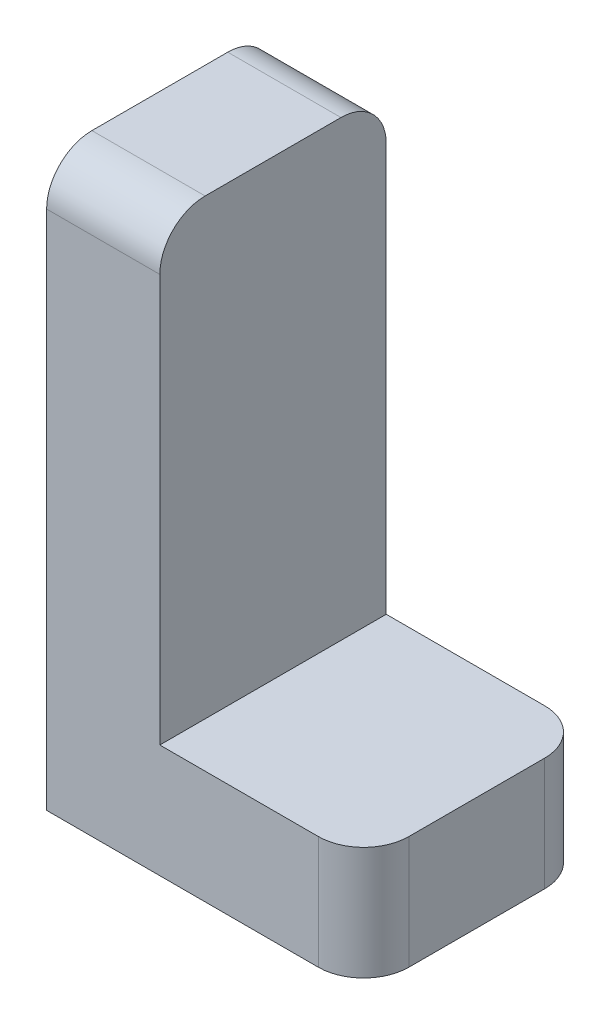
ISO-10303-21;
HEADER;
FILE_DESCRIPTION(('STEP AP214'),'2;1');
FILE_NAME('part.step','',(''),(''),'','','');
FILE_SCHEMA(('AUTOMOTIVE_DESIGN { 1 0 10303 214 1 1 1 1 }'));
ENDSEC;
DATA;
#1=APPLICATION_CONTEXT('core data for automotive mechanical design processes');
#2=APPLICATION_PROTOCOL_DEFINITION('international standard','automotive_design',2000,#1);
#3=PRODUCT_CONTEXT('',#1,'mechanical');
#4=PRODUCT('Part','Part','',(#3));
#5=PRODUCT_RELATED_PRODUCT_CATEGORY('part','',(#4));
#6=PRODUCT_DEFINITION_FORMATION('','',#4);
#7=PRODUCT_DEFINITION_CONTEXT('part definition',#1,'design');
#8=PRODUCT_DEFINITION('design','',#6,#7);
#9=PRODUCT_DEFINITION_SHAPE('','',#8);
#10=(LENGTH_UNIT() NAMED_UNIT(*) SI_UNIT(.MILLI.,.METRE.));
#11=(NAMED_UNIT(*) PLANE_ANGLE_UNIT() SI_UNIT($,.RADIAN.));
#12=(NAMED_UNIT(*) SI_UNIT($,.STERADIAN.) SOLID_ANGLE_UNIT());
#13=UNCERTAINTY_MEASURE_WITH_UNIT(LENGTH_MEASURE(1.E-05),#10,'distance_accuracy_value','');
#14=(GEOMETRIC_REPRESENTATION_CONTEXT(3) GLOBAL_UNCERTAINTY_ASSIGNED_CONTEXT((#13)) GLOBAL_UNIT_ASSIGNED_CONTEXT((#10,
#11,#12)) REPRESENTATION_CONTEXT('',''));
#15=CARTESIAN_POINT('',(0.,0.,0.));
#16=DIRECTION('',(0.,0.,1.));
#17=DIRECTION('',(1.,0.,0.));
#18=AXIS2_PLACEMENT_3D('',#15,#16,#17);
#19=CARTESIAN_POINT('',(12.,0.,2.));
#20=DIRECTION('',(0.,1.,0.));
#21=DIRECTION('',(0.,0.,1.));
#22=AXIS2_PLACEMENT_3D('',#19,#20,#21);
#23=CYLINDRICAL_SURFACE('',#22,2.);
#24=DIRECTION('',(0.,-1.,0.));
#25=VECTOR('',#24,1.);
#26=CARTESIAN_POINT('',(12.,0.,0.));
#27=LINE('',#26,#25);
#28=CARTESIAN_POINT('',(12.,5.,0.));
#29=VERTEX_POINT('',#28);
#30=CARTESIAN_POINT('',(12.,0.,0.));
#31=VERTEX_POINT('',#30);
#32=EDGE_CURVE('E288',#29,#31,#27,.T.);
#33=ORIENTED_EDGE('',*,*,#32,.F.);
#34=CARTESIAN_POINT('',(12.,5.,2.));
#35=DIRECTION('',(0.,-1.,0.));
#36=DIRECTION('',(0.,0.,-1.));
#37=AXIS2_PLACEMENT_3D('',#34,#35,#36);
#38=CIRCLE('',#37,2.);
#39=CARTESIAN_POINT('',(14.,5.,2.));
#40=VERTEX_POINT('',#39);
#41=EDGE_CURVE('E53',#40,#29,#38,.F.);
#42=ORIENTED_EDGE('',*,*,#41,.F.);
#43=DIRECTION('',(0.,-1.,0.));
#44=VECTOR('',#43,1.);
#45=CARTESIAN_POINT('',(14.,0.,2.));
#46=LINE('',#45,#44);
#47=CARTESIAN_POINT('',(14.,0.,2.));
#48=VERTEX_POINT('',#47);
#49=EDGE_CURVE('E292',#48,#40,#46,.F.);
#50=ORIENTED_EDGE('',*,*,#49,.F.);
#51=CARTESIAN_POINT('',(12.,0.,2.));
#52=DIRECTION('',(0.,1.,0.));
#53=DIRECTION('',(0.,0.,1.));
#54=AXIS2_PLACEMENT_3D('',#51,#52,#53);
#55=CIRCLE('',#54,2.);
#56=EDGE_CURVE('E11',#31,#48,#55,.F.);
#57=ORIENTED_EDGE('',*,*,#56,.F.);
#58=EDGE_LOOP('',(#33,#42,#50,#57));
#59=FACE_BOUND('',#58,.T.);
#60=ADVANCED_FACE('F45',(#59),#23,.T.);
#61=CARTESIAN_POINT('',(12.,0.,8.));
#62=DIRECTION('',(0.,1.,0.));
#63=DIRECTION('',(0.,0.,1.));
#64=AXIS2_PLACEMENT_3D('',#61,#62,#63);
#65=CYLINDRICAL_SURFACE('',#64,2.);
#66=DIRECTION('',(0.,1.,0.));
#67=VECTOR('',#66,1.);
#68=CARTESIAN_POINT('',(12.,0.,10.));
#69=LINE('',#68,#67);
#70=CARTESIAN_POINT('',(12.,0.,10.));
#71=VERTEX_POINT('',#70);
#72=CARTESIAN_POINT('',(12.,5.,10.));
#73=VERTEX_POINT('',#72);
#74=EDGE_CURVE('E274',#71,#73,#69,.T.);
#75=ORIENTED_EDGE('',*,*,#74,.F.);
#76=CARTESIAN_POINT('',(12.,0.,8.));
#77=DIRECTION('',(0.,1.,0.));
#78=DIRECTION('',(0.,0.,1.));
#79=AXIS2_PLACEMENT_3D('',#76,#77,#78);
#80=CIRCLE('',#79,2.);
#81=CARTESIAN_POINT('',(14.,0.,8.));
#82=VERTEX_POINT('',#81);
#83=EDGE_CURVE('E282',#82,#71,#80,.F.);
#84=ORIENTED_EDGE('',*,*,#83,.F.);
#85=DIRECTION('',(0.,1.,0.));
#86=VECTOR('',#85,1.);
#87=CARTESIAN_POINT('',(14.,5.,8.));
#88=LINE('',#87,#86);
#89=CARTESIAN_POINT('',(14.,5.,8.));
#90=VERTEX_POINT('',#89);
#91=EDGE_CURVE('E278',#90,#82,#88,.F.);
#92=ORIENTED_EDGE('',*,*,#91,.F.);
#93=CARTESIAN_POINT('',(12.,5.,8.));
#94=DIRECTION('',(0.,-1.,0.));
#95=DIRECTION('',(0.,0.,-1.));
#96=AXIS2_PLACEMENT_3D('',#93,#94,#95);
#97=CIRCLE('',#96,2.);
#98=EDGE_CURVE('E285',#73,#90,#97,.F.);
#99=ORIENTED_EDGE('',*,*,#98,.F.);
#100=EDGE_LOOP('',(#75,#84,#92,#99));
#101=FACE_BOUND('',#100,.T.);
#102=ADVANCED_FACE('F321',(#101),#65,.T.);
#103=CARTESIAN_POINT('',(0.,23.,2.));
#104=DIRECTION('',(-1.,0.,0.));
#105=DIRECTION('',(0.,0.,1.));
#106=AXIS2_PLACEMENT_3D('',#103,#104,#105);
#107=CYLINDRICAL_SURFACE('',#106,2.);
#108=DIRECTION('',(1.,0.,0.));
#109=VECTOR('',#108,1.);
#110=CARTESIAN_POINT('',(0.,23.,0.));
#111=LINE('',#110,#109);
#112=CARTESIAN_POINT('',(0.,23.,0.));
#113=VERTEX_POINT('',#112);
#114=CARTESIAN_POINT('',(5.,23.,0.));
#115=VERTEX_POINT('',#114);
#116=EDGE_CURVE('E260',#113,#115,#111,.T.);
#117=ORIENTED_EDGE('',*,*,#116,.F.);
#118=CARTESIAN_POINT('',(0.,23.,2.));
#119=DIRECTION('',(1.,0.,0.));
#120=DIRECTION('',(0.,0.,-1.));
#121=AXIS2_PLACEMENT_3D('',#118,#119,#120);
#122=CIRCLE('',#121,2.);
#123=CARTESIAN_POINT('',(0.,25.,2.));
#124=VERTEX_POINT('',#123);
#125=EDGE_CURVE('E268',#124,#113,#122,.F.);
#126=ORIENTED_EDGE('',*,*,#125,.F.);
#127=DIRECTION('',(1.,0.,0.));
#128=VECTOR('',#127,1.);
#129=CARTESIAN_POINT('',(0.,25.,2.));
#130=LINE('',#129,#128);
#131=CARTESIAN_POINT('',(5.,25.,2.));
#132=VERTEX_POINT('',#131);
#133=EDGE_CURVE('E264',#132,#124,#130,.F.);
#134=ORIENTED_EDGE('',*,*,#133,.F.);
#135=CARTESIAN_POINT('',(5.,23.,2.));
#136=DIRECTION('',(-1.,0.,0.));
#137=DIRECTION('',(0.,0.,1.));
#138=AXIS2_PLACEMENT_3D('',#135,#136,#137);
#139=CIRCLE('',#138,2.);
#140=EDGE_CURVE('E271',#115,#132,#139,.F.);
#141=ORIENTED_EDGE('',*,*,#140,.F.);
#142=EDGE_LOOP('',(#117,#126,#134,#141));
#143=FACE_BOUND('',#142,.T.);
#144=ADVANCED_FACE('F331',(#143),#107,.T.);
#145=CARTESIAN_POINT('',(0.,23.,8.));
#146=DIRECTION('',(-1.,0.,0.));
#147=DIRECTION('',(0.,0.,1.));
#148=AXIS2_PLACEMENT_3D('',#145,#146,#147);
#149=CYLINDRICAL_SURFACE('',#148,2.);
#150=DIRECTION('',(-1.,0.,0.));
#151=VECTOR('',#150,1.);
#152=CARTESIAN_POINT('',(0.,23.,10.));
#153=LINE('',#152,#151);
#154=CARTESIAN_POINT('',(5.,23.,10.));
#155=VERTEX_POINT('',#154);
#156=CARTESIAN_POINT('',(0.,23.,10.));
#157=VERTEX_POINT('',#156);
#158=EDGE_CURVE('E246',#155,#157,#153,.T.);
#159=ORIENTED_EDGE('',*,*,#158,.F.);
#160=CARTESIAN_POINT('',(5.,23.,8.));
#161=DIRECTION('',(-1.,0.,0.));
#162=DIRECTION('',(0.,0.,1.));
#163=AXIS2_PLACEMENT_3D('',#160,#161,#162);
#164=CIRCLE('',#163,2.);
#165=CARTESIAN_POINT('',(5.,25.,8.));
#166=VERTEX_POINT('',#165);
#167=EDGE_CURVE('E254',#166,#155,#164,.F.);
#168=ORIENTED_EDGE('',*,*,#167,.F.);
#169=DIRECTION('',(-1.,0.,0.));
#170=VECTOR('',#169,1.);
#171=CARTESIAN_POINT('',(0.,25.,8.));
#172=LINE('',#171,#170);
#173=CARTESIAN_POINT('',(0.,25.,8.));
#174=VERTEX_POINT('',#173);
#175=EDGE_CURVE('E250',#174,#166,#172,.F.);
#176=ORIENTED_EDGE('',*,*,#175,.F.);
#177=CARTESIAN_POINT('',(0.,23.,8.));
#178=DIRECTION('',(1.,0.,0.));
#179=DIRECTION('',(0.,0.,-1.));
#180=AXIS2_PLACEMENT_3D('',#177,#178,#179);
#181=CIRCLE('',#180,2.);
#182=EDGE_CURVE('E257',#157,#174,#181,.F.);
#183=ORIENTED_EDGE('',*,*,#182,.F.);
#184=EDGE_LOOP('',(#159,#168,#176,#183));
#185=FACE_BOUND('',#184,.T.);
#186=ADVANCED_FACE('F337',(#185),#149,.T.);
#187=CARTESIAN_POINT('',(14.,5.,10.));
#188=DIRECTION('',(-1.,0.,0.));
#189=DIRECTION('',(0.,0.,1.));
#190=AXIS2_PLACEMENT_3D('',#187,#188,#189);
#191=PLANE('',#190);
#192=DIRECTION('',(0.,0.,-1.));
#193=VECTOR('',#192,1.);
#194=CARTESIAN_POINT('',(14.,0.,10.));
#195=LINE('',#194,#193);
#196=EDGE_CURVE('E211',#82,#48,#195,.T.);
#197=ORIENTED_EDGE('',*,*,#196,.T.);
#198=ORIENTED_EDGE('',*,*,#49,.T.);
#199=DIRECTION('',(0.,0.,-1.));
#200=VECTOR('',#199,1.);
#201=CARTESIAN_POINT('',(14.,5.,10.));
#202=LINE('',#201,#200);
#203=EDGE_CURVE('E242',#90,#40,#202,.T.);
#204=ORIENTED_EDGE('',*,*,#203,.F.);
#205=ORIENTED_EDGE('',*,*,#91,.T.);
#206=EDGE_LOOP('',(#197,#198,#204,#205));
#207=FACE_BOUND('',#206,.T.);
#208=ADVANCED_FACE('F323',(#207),#191,.F.);
#209=CARTESIAN_POINT('',(14.,5.,10.));
#210=DIRECTION('',(0.,-1.,0.));
#211=DIRECTION('',(0.,0.,-1.));
#212=AXIS2_PLACEMENT_3D('',#209,#210,#211);
#213=PLANE('',#212);
#214=ORIENTED_EDGE('',*,*,#203,.T.);
#215=ORIENTED_EDGE('',*,*,#41,.T.);
#216=DIRECTION('',(-1.,0.,0.));
#217=VECTOR('',#216,1.);
#218=CARTESIAN_POINT('',(14.,5.,0.));
#219=LINE('',#218,#217);
#220=CARTESIAN_POINT('',(5.,5.,0.));
#221=VERTEX_POINT('',#220);
#222=EDGE_CURVE('E190',#29,#221,#219,.T.);
#223=ORIENTED_EDGE('',*,*,#222,.T.);
#224=DIRECTION('',(0.,0.,-1.));
#225=VECTOR('',#224,1.);
#226=CARTESIAN_POINT('',(5.,5.,10.));
#227=LINE('',#226,#225);
#228=CARTESIAN_POINT('',(5.,5.,10.));
#229=VERTEX_POINT('',#228);
#230=EDGE_CURVE('E238',#229,#221,#227,.T.);
#231=ORIENTED_EDGE('',*,*,#230,.F.);
#232=DIRECTION('',(-1.,0.,0.));
#233=VECTOR('',#232,1.);
#234=CARTESIAN_POINT('',(14.,5.,10.));
#235=LINE('',#234,#233);
#236=EDGE_CURVE('E196',#73,#229,#235,.T.);
#237=ORIENTED_EDGE('',*,*,#236,.F.);
#238=ORIENTED_EDGE('',*,*,#98,.T.);
#239=EDGE_LOOP('',(#214,#215,#223,#231,#237,#238));
#240=FACE_BOUND('',#239,.T.);
#241=ADVANCED_FACE('F298',(#240),#213,.F.);
#242=CARTESIAN_POINT('',(5.,5.,10.));
#243=DIRECTION('',(-1.,0.,0.));
#244=DIRECTION('',(0.,0.,1.));
#245=AXIS2_PLACEMENT_3D('',#242,#243,#244);
#246=PLANE('',#245);
#247=DIRECTION('',(0.,1.,0.));
#248=VECTOR('',#247,1.);
#249=CARTESIAN_POINT('',(5.,5.,0.));
#250=LINE('',#249,#248);
#251=EDGE_CURVE('E214',#221,#115,#250,.T.);
#252=ORIENTED_EDGE('',*,*,#251,.T.);
#253=ORIENTED_EDGE('',*,*,#140,.T.);
#254=DIRECTION('',(0.,0.,-1.));
#255=VECTOR('',#254,1.);
#256=CARTESIAN_POINT('',(5.,25.,10.));
#257=LINE('',#256,#255);
#258=EDGE_CURVE('E234',#166,#132,#257,.T.);
#259=ORIENTED_EDGE('',*,*,#258,.F.);
#260=ORIENTED_EDGE('',*,*,#167,.T.);
#261=DIRECTION('',(0.,1.,0.));
#262=VECTOR('',#261,1.);
#263=CARTESIAN_POINT('',(5.,5.,10.));
#264=LINE('',#263,#262);
#265=EDGE_CURVE('E199',#229,#155,#264,.T.);
#266=ORIENTED_EDGE('',*,*,#265,.F.);
#267=ORIENTED_EDGE('',*,*,#230,.T.);
#268=EDGE_LOOP('',(#252,#253,#259,#260,#266,#267));
#269=FACE_BOUND('',#268,.T.);
#270=ADVANCED_FACE('F310',(#269),#246,.F.);
#271=CARTESIAN_POINT('',(0.,25.,10.));
#272=DIRECTION('',(0.,-1.,0.));
#273=DIRECTION('',(0.,0.,-1.));
#274=AXIS2_PLACEMENT_3D('',#271,#272,#273);
#275=PLANE('',#274);
#276=ORIENTED_EDGE('',*,*,#258,.T.);
#277=ORIENTED_EDGE('',*,*,#133,.T.);
#278=DIRECTION('',(0.,0.,-1.));
#279=VECTOR('',#278,1.);
#280=CARTESIAN_POINT('',(0.,25.,10.));
#281=LINE('',#280,#279);
#282=EDGE_CURVE('E230',#174,#124,#281,.T.);
#283=ORIENTED_EDGE('',*,*,#282,.F.);
#284=ORIENTED_EDGE('',*,*,#175,.T.);
#285=EDGE_LOOP('',(#276,#277,#283,#284));
#286=FACE_BOUND('',#285,.T.);
#287=ADVANCED_FACE('F333',(#286),#275,.F.);
#288=CARTESIAN_POINT('',(0.,0.,10.));
#289=DIRECTION('',(1.,0.,0.));
#290=DIRECTION('',(0.,0.,-1.));
#291=AXIS2_PLACEMENT_3D('',#288,#289,#290);
#292=PLANE('',#291);
#293=ORIENTED_EDGE('',*,*,#282,.T.);
#294=ORIENTED_EDGE('',*,*,#125,.T.);
#295=DIRECTION('',(0.,-1.,0.));
#296=VECTOR('',#295,1.);
#297=CARTESIAN_POINT('',(0.,0.,0.));
#298=LINE('',#297,#296);
#299=CARTESIAN_POINT('',(0.,0.,0.));
#300=VERTEX_POINT('',#299);
#301=EDGE_CURVE('E218',#113,#300,#298,.T.);
#302=ORIENTED_EDGE('',*,*,#301,.T.);
#303=DIRECTION('',(0.,0.,-1.));
#304=VECTOR('',#303,1.);
#305=CARTESIAN_POINT('',(0.,0.,10.));
#306=LINE('',#305,#304);
#307=CARTESIAN_POINT('',(0.,0.,10.));
#308=VERTEX_POINT('',#307);
#309=EDGE_CURVE('E226',#308,#300,#306,.T.);
#310=ORIENTED_EDGE('',*,*,#309,.F.);
#311=DIRECTION('',(0.,-1.,0.));
#312=VECTOR('',#311,1.);
#313=CARTESIAN_POINT('',(0.,0.,10.));
#314=LINE('',#313,#312);
#315=EDGE_CURVE('E204',#157,#308,#314,.T.);
#316=ORIENTED_EDGE('',*,*,#315,.F.);
#317=ORIENTED_EDGE('',*,*,#182,.T.);
#318=EDGE_LOOP('',(#293,#294,#302,#310,#316,#317));
#319=FACE_BOUND('',#318,.T.);
#320=ADVANCED_FACE('F328',(#319),#292,.F.);
#321=CARTESIAN_POINT('',(14.,0.,10.));
#322=DIRECTION('',(0.,1.,0.));
#323=DIRECTION('',(0.,0.,1.));
#324=AXIS2_PLACEMENT_3D('',#321,#322,#323);
#325=PLANE('',#324);
#326=DIRECTION('',(1.,0.,0.));
#327=VECTOR('',#326,1.);
#328=CARTESIAN_POINT('',(1.084384041586,0.,1.56191801324939));
#329=LINE('',#328,#327);
#330=CARTESIAN_POINT('',(1.084384041586,0.,1.56191801324938));
#331=VERTEX_POINT('',#330);
#332=CARTESIAN_POINT('',(12.2654288529898,0.,1.56191801324939));
#333=VERTEX_POINT('',#332);
#334=EDGE_CURVE('E181',#331,#333,#329,.T.);
#335=ORIENTED_EDGE('',*,*,#334,.F.);
#336=DIRECTION('',(0.,0.,-1.));
#337=VECTOR('',#336,1.);
#338=CARTESIAN_POINT('',(1.084384041586,0.,8.79188980478765));
#339=LINE('',#338,#337);
#340=CARTESIAN_POINT('',(1.084384041586,0.,8.79188980478765));
#341=VERTEX_POINT('',#340);
#342=EDGE_CURVE('E60',#341,#331,#339,.T.);
#343=ORIENTED_EDGE('',*,*,#342,.F.);
#344=DIRECTION('',(-1.,0.,0.));
#345=VECTOR('',#344,1.);
#346=CARTESIAN_POINT('',(1.084384041586,0.,8.79188980478765));
#347=LINE('',#346,#345);
#348=CARTESIAN_POINT('',(12.2654288529898,0.,8.79188980478765));
#349=VERTEX_POINT('',#348);
#350=EDGE_CURVE('E168',#349,#341,#347,.T.);
#351=ORIENTED_EDGE('',*,*,#350,.F.);
#352=DIRECTION('',(0.,0.,1.));
#353=VECTOR('',#352,1.);
#354=CARTESIAN_POINT('',(12.2654288529898,0.,8.79188980478765));
#355=LINE('',#354,#353);
#356=EDGE_CURVE('E172',#333,#349,#355,.T.);
#357=ORIENTED_EDGE('',*,*,#356,.F.);
#358=EDGE_LOOP('',(#335,#343,#351,#357));
#359=FACE_BOUND('',#358,.T.);
#360=DIRECTION('',(1.,0.,0.));
#361=VECTOR('',#360,1.);
#362=CARTESIAN_POINT('',(14.,0.,0.));
#363=LINE('',#362,#361);
#364=EDGE_CURVE('E200',#300,#31,#363,.T.);
#365=ORIENTED_EDGE('',*,*,#364,.T.);
#366=ORIENTED_EDGE('',*,*,#56,.T.);
#367=ORIENTED_EDGE('',*,*,#196,.F.);
#368=ORIENTED_EDGE('',*,*,#83,.T.);
#369=DIRECTION('',(1.,0.,0.));
#370=VECTOR('',#369,1.);
#371=CARTESIAN_POINT('',(14.,0.,10.));
#372=LINE('',#371,#370);
#373=EDGE_CURVE('E207',#308,#71,#372,.T.);
#374=ORIENTED_EDGE('',*,*,#373,.F.);
#375=ORIENTED_EDGE('',*,*,#309,.T.);
#376=EDGE_LOOP('',(#365,#366,#367,#368,#374,#375));
#377=FACE_BOUND('',#376,.T.);
#378=ADVANCED_FACE('F324',(#359,#377),#325,.F.);
#379=CARTESIAN_POINT('',(0.,0.,10.));
#380=DIRECTION('',(0.,0.,-1.));
#381=DIRECTION('',(-1.,0.,0.));
#382=AXIS2_PLACEMENT_3D('',#379,#380,#381);
#383=PLANE('',#382);
#384=ORIENTED_EDGE('',*,*,#373,.T.);
#385=ORIENTED_EDGE('',*,*,#74,.T.);
#386=ORIENTED_EDGE('',*,*,#236,.T.);
#387=ORIENTED_EDGE('',*,*,#265,.T.);
#388=ORIENTED_EDGE('',*,*,#158,.T.);
#389=ORIENTED_EDGE('',*,*,#315,.T.);
#390=EDGE_LOOP('',(#384,#385,#386,#387,#388,#389));
#391=FACE_BOUND('',#390,.T.);
#392=ADVANCED_FACE('F317',(#391),#383,.F.);
#393=CARTESIAN_POINT('',(0.,0.,0.));
#394=DIRECTION('',(0.,0.,-1.));
#395=DIRECTION('',(-1.,0.,0.));
#396=AXIS2_PLACEMENT_3D('',#393,#394,#395);
#397=PLANE('',#396);
#398=ORIENTED_EDGE('',*,*,#222,.F.);
#399=ORIENTED_EDGE('',*,*,#32,.T.);
#400=ORIENTED_EDGE('',*,*,#364,.F.);
#401=ORIENTED_EDGE('',*,*,#301,.F.);
#402=ORIENTED_EDGE('',*,*,#116,.T.);
#403=ORIENTED_EDGE('',*,*,#251,.F.);
#404=EDGE_LOOP('',(#398,#399,#400,#401,#402,#403));
#405=FACE_BOUND('',#404,.T.);
#406=ADVANCED_FACE('F306',(#405),#397,.T.);
#407=CARTESIAN_POINT('',(1.084384041586,4.,8.79188980478765));
#408=DIRECTION('',(-1.,0.,0.));
#409=DIRECTION('',(0.,0.,1.));
#410=AXIS2_PLACEMENT_3D('',#407,#408,#409);
#411=PLANE('',#410);
#412=ORIENTED_EDGE('',*,*,#342,.T.);
#413=DIRECTION('',(0.,-1.,0.));
#414=VECTOR('',#413,1.);
#415=CARTESIAN_POINT('',(1.084384041586,4.,1.56191801324939));
#416=LINE('',#415,#414);
#417=CARTESIAN_POINT('',(1.084384041586,4.,1.56191801324939));
#418=VERTEX_POINT('',#417);
#419=EDGE_CURVE('E143',#418,#331,#416,.T.);
#420=ORIENTED_EDGE('',*,*,#419,.F.);
#421=DIRECTION('',(0.,0.,-1.));
#422=VECTOR('',#421,1.);
#423=CARTESIAN_POINT('',(1.084384041586,4.,8.79188980478765));
#424=LINE('',#423,#422);
#425=CARTESIAN_POINT('',(1.084384041586,4.,8.79188980478765));
#426=VERTEX_POINT('',#425);
#427=EDGE_CURVE('E147',#426,#418,#424,.T.);
#428=ORIENTED_EDGE('',*,*,#427,.F.);
#429=DIRECTION('',(0.,-1.,0.));
#430=VECTOR('',#429,1.);
#431=CARTESIAN_POINT('',(1.084384041586,4.,8.79188980478765));
#432=LINE('',#431,#430);
#433=EDGE_CURVE('E187',#426,#341,#432,.T.);
#434=ORIENTED_EDGE('',*,*,#433,.T.);
#435=EDGE_LOOP('',(#412,#420,#428,#434));
#436=FACE_BOUND('',#435,.T.);
#437=ADVANCED_FACE('F145',(#436),#411,.F.);
#438=CARTESIAN_POINT('',(1.084384041586,4.,8.79188980478765));
#439=DIRECTION('',(0.,0.,1.));
#440=DIRECTION('',(1.,0.,0.));
#441=AXIS2_PLACEMENT_3D('',#438,#439,#440);
#442=PLANE('',#441);
#443=ORIENTED_EDGE('',*,*,#350,.T.);
#444=ORIENTED_EDGE('',*,*,#433,.F.);
#445=DIRECTION('',(-1.,0.,0.));
#446=VECTOR('',#445,1.);
#447=CARTESIAN_POINT('',(1.084384041586,4.,8.79188980478765));
#448=LINE('',#447,#446);
#449=CARTESIAN_POINT('',(12.2654288529898,4.,8.79188980478765));
#450=VERTEX_POINT('',#449);
#451=EDGE_CURVE('E154',#450,#426,#448,.T.);
#452=ORIENTED_EDGE('',*,*,#451,.F.);
#453=DIRECTION('',(0.,-1.,0.));
#454=VECTOR('',#453,1.);
#455=CARTESIAN_POINT('',(12.2654288529898,4.,8.79188980478765));
#456=LINE('',#455,#454);
#457=EDGE_CURVE('E191',#450,#349,#456,.T.);
#458=ORIENTED_EDGE('',*,*,#457,.T.);
#459=EDGE_LOOP('',(#443,#444,#452,#458));
#460=FACE_BOUND('',#459,.T.);
#461=ADVANCED_FACE('F416',(#460),#442,.F.);
#462=CARTESIAN_POINT('',(12.2654288529898,4.,8.79188980478765));
#463=DIRECTION('',(1.,0.,0.));
#464=DIRECTION('',(0.,0.,-1.));
#465=AXIS2_PLACEMENT_3D('',#462,#463,#464);
#466=PLANE('',#465);
#467=ORIENTED_EDGE('',*,*,#356,.T.);
#468=ORIENTED_EDGE('',*,*,#457,.F.);
#469=DIRECTION('',(0.,0.,1.));
#470=VECTOR('',#469,1.);
#471=CARTESIAN_POINT('',(12.2654288529898,4.,8.79188980478765));
#472=LINE('',#471,#470);
#473=CARTESIAN_POINT('',(12.2654288529898,4.,1.56191801324939));
#474=VERTEX_POINT('',#473);
#475=EDGE_CURVE('E163',#474,#450,#472,.T.);
#476=ORIENTED_EDGE('',*,*,#475,.F.);
#477=DIRECTION('',(0.,-1.,0.));
#478=VECTOR('',#477,1.);
#479=CARTESIAN_POINT('',(12.2654288529898,4.,1.56191801324939));
#480=LINE('',#479,#478);
#481=EDGE_CURVE('E153',#474,#333,#480,.T.);
#482=ORIENTED_EDGE('',*,*,#481,.T.);
#483=EDGE_LOOP('',(#467,#468,#476,#482));
#484=FACE_BOUND('',#483,.T.);
#485=ADVANCED_FACE('F423',(#484),#466,.F.);
#486=CARTESIAN_POINT('',(1.084384041586,4.,1.56191801324939));
#487=DIRECTION('',(0.,0.,-1.));
#488=DIRECTION('',(-1.,0.,0.));
#489=AXIS2_PLACEMENT_3D('',#486,#487,#488);
#490=PLANE('',#489);
#491=ORIENTED_EDGE('',*,*,#334,.T.);
#492=ORIENTED_EDGE('',*,*,#481,.F.);
#493=DIRECTION('',(1.,0.,0.));
#494=VECTOR('',#493,1.);
#495=CARTESIAN_POINT('',(1.084384041586,4.,1.56191801324939));
#496=LINE('',#495,#494);
#497=EDGE_CURVE('E157',#418,#474,#496,.T.);
#498=ORIENTED_EDGE('',*,*,#497,.F.);
#499=ORIENTED_EDGE('',*,*,#419,.T.);
#500=EDGE_LOOP('',(#491,#492,#498,#499));
#501=FACE_BOUND('',#500,.T.);
#502=ADVANCED_FACE('F158',(#501),#490,.F.);
#503=CARTESIAN_POINT('',(0.,4.,0.));
#504=DIRECTION('',(0.,-1.,0.));
#505=DIRECTION('',(0.,0.,-1.));
#506=AXIS2_PLACEMENT_3D('',#503,#504,#505);
#507=PLANE('',#506);
#508=ORIENTED_EDGE('',*,*,#427,.T.);
#509=ORIENTED_EDGE('',*,*,#497,.T.);
#510=ORIENTED_EDGE('',*,*,#475,.T.);
#511=ORIENTED_EDGE('',*,*,#451,.T.);
#512=EDGE_LOOP('',(#508,#509,#510,#511));
#513=FACE_BOUND('',#512,.T.);
#514=ADVANCED_FACE('F165',(#513),#507,.T.);
#515=CLOSED_SHELL('',(#60,#102,#144,#186,#208,#241,#270,#287,#320,#378,#392,#406,#437,#461,#485,
#502,#514));
#516=MANIFOLD_SOLID_BREP('B2',#515);
#517=ADVANCED_BREP_SHAPE_REPRESENTATION('',(#18,#516),#14);
#518=SHAPE_DEFINITION_REPRESENTATION(#9,#517);
ENDSEC;
END-ISO-10303-21;
